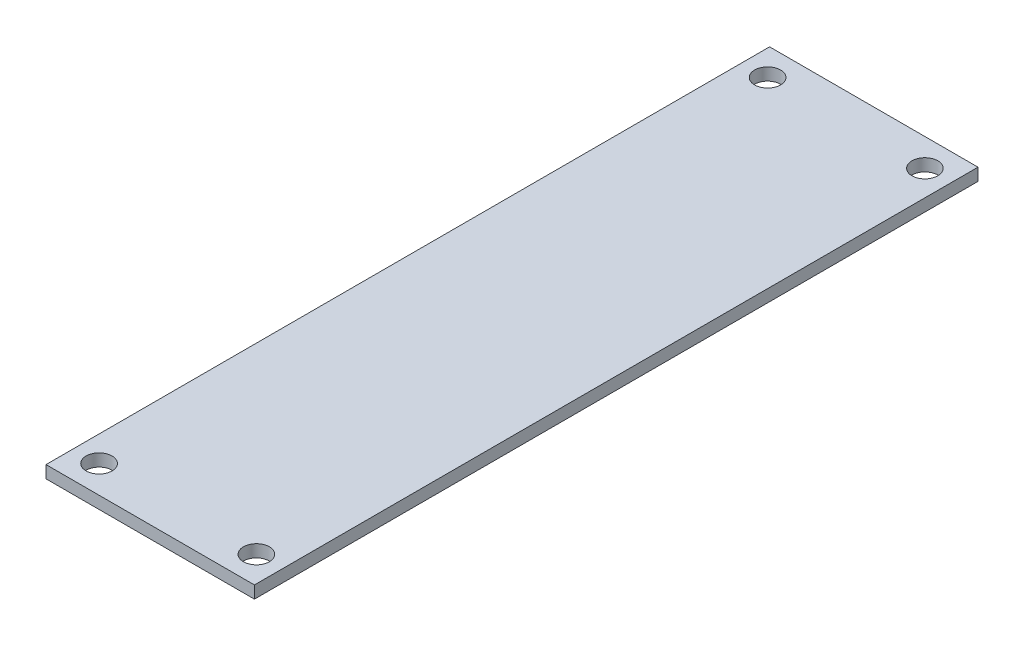
ISO-10303-21;
HEADER;
FILE_DESCRIPTION(('STEP AP214'),'2;1');
FILE_NAME('part.step','',(''),(''),'','','');
FILE_SCHEMA(('AUTOMOTIVE_DESIGN { 1 0 10303 214 1 1 1 1 }'));
ENDSEC;
DATA;
#1=APPLICATION_CONTEXT('core data for automotive mechanical design processes');
#2=APPLICATION_PROTOCOL_DEFINITION('international standard','automotive_design',2000,#1);
#3=PRODUCT_CONTEXT('',#1,'mechanical');
#4=PRODUCT('Part','Part','',(#3));
#5=PRODUCT_RELATED_PRODUCT_CATEGORY('part','',(#4));
#6=PRODUCT_DEFINITION_FORMATION('','',#4);
#7=PRODUCT_DEFINITION_CONTEXT('part definition',#1,'design');
#8=PRODUCT_DEFINITION('design','',#6,#7);
#9=PRODUCT_DEFINITION_SHAPE('','',#8);
#10=(LENGTH_UNIT() NAMED_UNIT(*) SI_UNIT(.MILLI.,.METRE.));
#11=(NAMED_UNIT(*) PLANE_ANGLE_UNIT() SI_UNIT($,.RADIAN.));
#12=(NAMED_UNIT(*) SI_UNIT($,.STERADIAN.) SOLID_ANGLE_UNIT());
#13=UNCERTAINTY_MEASURE_WITH_UNIT(LENGTH_MEASURE(1.E-05),#10,'distance_accuracy_value','');
#14=(GEOMETRIC_REPRESENTATION_CONTEXT(3) GLOBAL_UNCERTAINTY_ASSIGNED_CONTEXT((#13)) GLOBAL_UNIT_ASSIGNED_CONTEXT((#10,
#11,#12)) REPRESENTATION_CONTEXT('',''));
#15=CARTESIAN_POINT('',(0.,0.,0.));
#16=DIRECTION('',(0.,0.,1.));
#17=DIRECTION('',(1.,0.,0.));
#18=AXIS2_PLACEMENT_3D('',#15,#16,#17);
#19=CARTESIAN_POINT('',(0.,1.57,0.));
#20=DIRECTION('',(0.,-1.,0.));
#21=DIRECTION('',(0.,0.,-1.));
#22=AXIS2_PLACEMENT_3D('',#19,#20,#21);
#23=PLANE('',#22);
#24=DIRECTION('',(0.,0.,1.));
#25=VECTOR('',#24,1.);
#26=CARTESIAN_POINT('',(-13.25,1.57,-46.));
#27=LINE('',#26,#25);
#28=CARTESIAN_POINT('',(-13.25,1.57,-46.));
#29=VERTEX_POINT('',#28);
#30=CARTESIAN_POINT('',(-13.25,1.57,46.));
#31=VERTEX_POINT('',#30);
#32=EDGE_CURVE('E85',#29,#31,#27,.T.);
#33=ORIENTED_EDGE('',*,*,#32,.T.);
#34=DIRECTION('',(1.,0.,0.));
#35=VECTOR('',#34,1.);
#36=CARTESIAN_POINT('',(13.25,1.57,46.));
#37=LINE('',#36,#35);
#38=CARTESIAN_POINT('',(13.25,1.57,46.));
#39=VERTEX_POINT('',#38);
#40=EDGE_CURVE('E80',#31,#39,#37,.T.);
#41=ORIENTED_EDGE('',*,*,#40,.T.);
#42=DIRECTION('',(0.,0.,-1.));
#43=VECTOR('',#42,1.);
#44=CARTESIAN_POINT('',(13.25,1.57,-46.));
#45=LINE('',#44,#43);
#46=CARTESIAN_POINT('',(13.25,1.57,-46.));
#47=VERTEX_POINT('',#46);
#48=EDGE_CURVE('E83',#39,#47,#45,.T.);
#49=ORIENTED_EDGE('',*,*,#48,.T.);
#50=DIRECTION('',(-1.,0.,0.));
#51=VECTOR('',#50,1.);
#52=CARTESIAN_POINT('',(13.25,1.57,-46.));
#53=LINE('',#52,#51);
#54=EDGE_CURVE('E50',#47,#29,#53,.T.);
#55=ORIENTED_EDGE('',*,*,#54,.T.);
#56=EDGE_LOOP('',(#33,#41,#49,#55));
#57=FACE_BOUND('',#56,.T.);
#58=CARTESIAN_POINT('',(-10.,1.57,-42.5));
#59=DIRECTION('',(0.,1.,0.));
#60=DIRECTION('',(0.,0.,1.));
#61=AXIS2_PLACEMENT_3D('',#58,#59,#60);
#62=CIRCLE('',#61,1.65);
#63=CARTESIAN_POINT('',(-10.,1.57,-40.85));
#64=VERTEX_POINT('',#63);
#65=EDGE_CURVE('E100',#64,#64,#62,.T.);
#66=ORIENTED_EDGE('',*,*,#65,.F.);
#67=EDGE_LOOP('',(#66));
#68=FACE_BOUND('',#67,.T.);
#69=CARTESIAN_POINT('',(9.99999999999999,1.57,-42.5));
#70=DIRECTION('',(0.,1.,0.));
#71=DIRECTION('',(0.,0.,-1.));
#72=AXIS2_PLACEMENT_3D('',#69,#70,#71);
#73=CIRCLE('',#72,1.65);
#74=CARTESIAN_POINT('',(9.99999999999999,1.57,-44.15));
#75=VERTEX_POINT('',#74);
#76=EDGE_CURVE('E115',#75,#75,#73,.T.);
#77=ORIENTED_EDGE('',*,*,#76,.F.);
#78=EDGE_LOOP('',(#77));
#79=FACE_BOUND('',#78,.T.);
#80=CARTESIAN_POINT('',(9.99999999999999,1.57,42.5));
#81=DIRECTION('',(0.,1.,0.));
#82=DIRECTION('',(0.,0.,1.));
#83=AXIS2_PLACEMENT_3D('',#80,#81,#82);
#84=CIRCLE('',#83,1.65);
#85=CARTESIAN_POINT('',(9.99999999999999,1.57,44.15));
#86=VERTEX_POINT('',#85);
#87=EDGE_CURVE('E121',#86,#86,#84,.T.);
#88=ORIENTED_EDGE('',*,*,#87,.F.);
#89=EDGE_LOOP('',(#88));
#90=FACE_BOUND('',#89,.T.);
#91=CARTESIAN_POINT('',(-10.,1.57,42.5));
#92=DIRECTION('',(0.,1.,0.));
#93=DIRECTION('',(0.,0.,-1.));
#94=AXIS2_PLACEMENT_3D('',#91,#92,#93);
#95=CIRCLE('',#94,1.65);
#96=CARTESIAN_POINT('',(-10.,1.57,40.85));
#97=VERTEX_POINT('',#96);
#98=EDGE_CURVE('E127',#97,#97,#95,.T.);
#99=ORIENTED_EDGE('',*,*,#98,.F.);
#100=EDGE_LOOP('',(#99));
#101=FACE_BOUND('',#100,.T.);
#102=ADVANCED_FACE('F33',(#57,#68,#79,#90,#101),#23,.F.);
#103=CARTESIAN_POINT('',(0.,0.,0.));
#104=DIRECTION('',(0.,-1.,0.));
#105=DIRECTION('',(0.,0.,-1.));
#106=AXIS2_PLACEMENT_3D('',#103,#104,#105);
#107=PLANE('',#106);
#108=CARTESIAN_POINT('',(9.99999999999999,0.,42.5));
#109=DIRECTION('',(0.,1.,0.));
#110=DIRECTION('',(0.,0.,1.));
#111=AXIS2_PLACEMENT_3D('',#108,#109,#110);
#112=CIRCLE('',#111,1.65);
#113=CARTESIAN_POINT('',(9.99999999999999,0.,44.15));
#114=VERTEX_POINT('',#113);
#115=EDGE_CURVE('E124',#114,#114,#112,.T.);
#116=ORIENTED_EDGE('',*,*,#115,.T.);
#117=EDGE_LOOP('',(#116));
#118=FACE_BOUND('',#117,.T.);
#119=CARTESIAN_POINT('',(-10.,0.,-42.5));
#120=DIRECTION('',(0.,1.,0.));
#121=DIRECTION('',(0.,0.,1.));
#122=AXIS2_PLACEMENT_3D('',#119,#120,#121);
#123=CIRCLE('',#122,1.65);
#124=CARTESIAN_POINT('',(-10.,0.,-40.85));
#125=VERTEX_POINT('',#124);
#126=EDGE_CURVE('E112',#125,#125,#123,.T.);
#127=ORIENTED_EDGE('',*,*,#126,.T.);
#128=EDGE_LOOP('',(#127));
#129=FACE_BOUND('',#128,.T.);
#130=DIRECTION('',(0.,0.,1.));
#131=VECTOR('',#130,1.);
#132=CARTESIAN_POINT('',(-13.25,0.,-46.));
#133=LINE('',#132,#131);
#134=CARTESIAN_POINT('',(-13.25,0.,-46.));
#135=VERTEX_POINT('',#134);
#136=CARTESIAN_POINT('',(-13.25,0.,46.));
#137=VERTEX_POINT('',#136);
#138=EDGE_CURVE('E97',#135,#137,#133,.T.);
#139=ORIENTED_EDGE('',*,*,#138,.F.);
#140=DIRECTION('',(-1.,0.,0.));
#141=VECTOR('',#140,1.);
#142=CARTESIAN_POINT('',(13.25,0.,-46.));
#143=LINE('',#142,#141);
#144=CARTESIAN_POINT('',(13.25,0.,-46.));
#145=VERTEX_POINT('',#144);
#146=EDGE_CURVE('E73',#145,#135,#143,.T.);
#147=ORIENTED_EDGE('',*,*,#146,.F.);
#148=DIRECTION('',(0.,0.,-1.));
#149=VECTOR('',#148,1.);
#150=CARTESIAN_POINT('',(13.25,0.,-46.));
#151=LINE('',#150,#149);
#152=CARTESIAN_POINT('',(13.25,0.,46.));
#153=VERTEX_POINT('',#152);
#154=EDGE_CURVE('E67',#153,#145,#151,.T.);
#155=ORIENTED_EDGE('',*,*,#154,.F.);
#156=DIRECTION('',(1.,0.,0.));
#157=VECTOR('',#156,1.);
#158=CARTESIAN_POINT('',(13.25,0.,46.));
#159=LINE('',#158,#157);
#160=EDGE_CURVE('E89',#137,#153,#159,.T.);
#161=ORIENTED_EDGE('',*,*,#160,.F.);
#162=EDGE_LOOP('',(#139,#147,#155,#161));
#163=FACE_BOUND('',#162,.T.);
#164=CARTESIAN_POINT('',(9.99999999999999,0.,-42.5));
#165=DIRECTION('',(0.,1.,0.));
#166=DIRECTION('',(0.,0.,-1.));
#167=AXIS2_PLACEMENT_3D('',#164,#165,#166);
#168=CIRCLE('',#167,1.65);
#169=CARTESIAN_POINT('',(9.99999999999999,0.,-44.15));
#170=VERTEX_POINT('',#169);
#171=EDGE_CURVE('E118',#170,#170,#168,.T.);
#172=ORIENTED_EDGE('',*,*,#171,.T.);
#173=EDGE_LOOP('',(#172));
#174=FACE_BOUND('',#173,.T.);
#175=CARTESIAN_POINT('',(-10.,0.,42.5));
#176=DIRECTION('',(0.,1.,0.));
#177=DIRECTION('',(0.,0.,-1.));
#178=AXIS2_PLACEMENT_3D('',#175,#176,#177);
#179=CIRCLE('',#178,1.65);
#180=CARTESIAN_POINT('',(-10.,0.,40.85));
#181=VERTEX_POINT('',#180);
#182=EDGE_CURVE('E130',#181,#181,#179,.T.);
#183=ORIENTED_EDGE('',*,*,#182,.T.);
#184=EDGE_LOOP('',(#183));
#185=FACE_BOUND('',#184,.T.);
#186=ADVANCED_FACE('F108',(#118,#129,#163,#174,#185),#107,.T.);
#187=CARTESIAN_POINT('',(-13.25,1.57,-46.));
#188=DIRECTION('',(1.,0.,0.));
#189=DIRECTION('',(0.,0.,-1.));
#190=AXIS2_PLACEMENT_3D('',#187,#188,#189);
#191=PLANE('',#190);
#192=ORIENTED_EDGE('',*,*,#138,.T.);
#193=DIRECTION('',(0.,-1.,0.));
#194=VECTOR('',#193,1.);
#195=CARTESIAN_POINT('',(-13.25,1.57,46.));
#196=LINE('',#195,#194);
#197=EDGE_CURVE('E11',#31,#137,#196,.T.);
#198=ORIENTED_EDGE('',*,*,#197,.F.);
#199=ORIENTED_EDGE('',*,*,#32,.F.);
#200=DIRECTION('',(0.,-1.,0.));
#201=VECTOR('',#200,1.);
#202=CARTESIAN_POINT('',(-13.25,1.57,-46.));
#203=LINE('',#202,#201);
#204=EDGE_CURVE('E93',#29,#135,#203,.T.);
#205=ORIENTED_EDGE('',*,*,#204,.T.);
#206=EDGE_LOOP('',(#192,#198,#199,#205));
#207=FACE_BOUND('',#206,.T.);
#208=ADVANCED_FACE('F35',(#207),#191,.F.);
#209=CARTESIAN_POINT('',(13.25,1.57,46.));
#210=DIRECTION('',(0.,0.,-1.));
#211=DIRECTION('',(-1.,0.,0.));
#212=AXIS2_PLACEMENT_3D('',#209,#210,#211);
#213=PLANE('',#212);
#214=ORIENTED_EDGE('',*,*,#160,.T.);
#215=DIRECTION('',(0.,-1.,0.));
#216=VECTOR('',#215,1.);
#217=CARTESIAN_POINT('',(13.25,1.57,46.));
#218=LINE('',#217,#216);
#219=EDGE_CURVE('E42',#39,#153,#218,.T.);
#220=ORIENTED_EDGE('',*,*,#219,.F.);
#221=ORIENTED_EDGE('',*,*,#40,.F.);
#222=ORIENTED_EDGE('',*,*,#197,.T.);
#223=EDGE_LOOP('',(#214,#220,#221,#222));
#224=FACE_BOUND('',#223,.T.);
#225=ADVANCED_FACE('F88',(#224),#213,.F.);
#226=CARTESIAN_POINT('',(13.25,1.57,-46.));
#227=DIRECTION('',(-1.,0.,0.));
#228=DIRECTION('',(0.,0.,1.));
#229=AXIS2_PLACEMENT_3D('',#226,#227,#228);
#230=PLANE('',#229);
#231=ORIENTED_EDGE('',*,*,#154,.T.);
#232=DIRECTION('',(0.,-1.,0.));
#233=VECTOR('',#232,1.);
#234=CARTESIAN_POINT('',(13.25,1.57,-46.));
#235=LINE('',#234,#233);
#236=EDGE_CURVE('E90',#47,#145,#235,.T.);
#237=ORIENTED_EDGE('',*,*,#236,.F.);
#238=ORIENTED_EDGE('',*,*,#48,.F.);
#239=ORIENTED_EDGE('',*,*,#219,.T.);
#240=EDGE_LOOP('',(#231,#237,#238,#239));
#241=FACE_BOUND('',#240,.T.);
#242=ADVANCED_FACE('F91',(#241),#230,.F.);
#243=CARTESIAN_POINT('',(13.25,1.57,-46.));
#244=DIRECTION('',(0.,0.,1.));
#245=DIRECTION('',(1.,0.,0.));
#246=AXIS2_PLACEMENT_3D('',#243,#244,#245);
#247=PLANE('',#246);
#248=ORIENTED_EDGE('',*,*,#146,.T.);
#249=ORIENTED_EDGE('',*,*,#204,.F.);
#250=ORIENTED_EDGE('',*,*,#54,.F.);
#251=ORIENTED_EDGE('',*,*,#236,.T.);
#252=EDGE_LOOP('',(#248,#249,#250,#251));
#253=FACE_BOUND('',#252,.T.);
#254=ADVANCED_FACE('F105',(#253),#247,.F.);
#255=CARTESIAN_POINT('',(-10.,1.57,-42.5));
#256=DIRECTION('',(0.,-1.,0.));
#257=DIRECTION('',(0.,0.,-1.));
#258=AXIS2_PLACEMENT_3D('',#255,#256,#257);
#259=CYLINDRICAL_SURFACE('',#258,1.65);
#260=ORIENTED_EDGE('',*,*,#65,.T.);
#261=EDGE_LOOP('',(#260));
#262=FACE_BOUND('',#261,.T.);
#263=ORIENTED_EDGE('',*,*,#126,.F.);
#264=EDGE_LOOP('',(#263));
#265=FACE_BOUND('',#264,.T.);
#266=ADVANCED_FACE('F147',(#262,#265),#259,.F.);
#267=CARTESIAN_POINT('',(9.99999999999999,1.57,-42.5));
#268=DIRECTION('',(0.,-1.,0.));
#269=DIRECTION('',(0.,0.,-1.));
#270=AXIS2_PLACEMENT_3D('',#267,#268,#269);
#271=CYLINDRICAL_SURFACE('',#270,1.65);
#272=ORIENTED_EDGE('',*,*,#76,.T.);
#273=EDGE_LOOP('',(#272));
#274=FACE_BOUND('',#273,.T.);
#275=ORIENTED_EDGE('',*,*,#171,.F.);
#276=EDGE_LOOP('',(#275));
#277=FACE_BOUND('',#276,.T.);
#278=ADVANCED_FACE('F193',(#274,#277),#271,.F.);
#279=CARTESIAN_POINT('',(9.99999999999999,1.57,42.5));
#280=DIRECTION('',(0.,-1.,0.));
#281=DIRECTION('',(0.,0.,-1.));
#282=AXIS2_PLACEMENT_3D('',#279,#280,#281);
#283=CYLINDRICAL_SURFACE('',#282,1.65);
#284=ORIENTED_EDGE('',*,*,#87,.T.);
#285=EDGE_LOOP('',(#284));
#286=FACE_BOUND('',#285,.T.);
#287=ORIENTED_EDGE('',*,*,#115,.F.);
#288=EDGE_LOOP('',(#287));
#289=FACE_BOUND('',#288,.T.);
#290=ADVANCED_FACE('F201',(#286,#289),#283,.F.);
#291=CARTESIAN_POINT('',(-10.,1.57,42.5));
#292=DIRECTION('',(0.,-1.,0.));
#293=DIRECTION('',(0.,0.,-1.));
#294=AXIS2_PLACEMENT_3D('',#291,#292,#293);
#295=CYLINDRICAL_SURFACE('',#294,1.65);
#296=ORIENTED_EDGE('',*,*,#98,.T.);
#297=EDGE_LOOP('',(#296));
#298=FACE_BOUND('',#297,.T.);
#299=ORIENTED_EDGE('',*,*,#182,.F.);
#300=EDGE_LOOP('',(#299));
#301=FACE_BOUND('',#300,.T.);
#302=ADVANCED_FACE('F136',(#298,#301),#295,.F.);
#303=CLOSED_SHELL('',(#102,#186,#208,#225,#242,#254,#266,#278,#290,#302));
#304=MANIFOLD_SOLID_BREP('B2',#303);
#305=ADVANCED_BREP_SHAPE_REPRESENTATION('',(#18,#304),#14);
#306=SHAPE_DEFINITION_REPRESENTATION(#9,#305);
ENDSEC;
END-ISO-10303-21;
